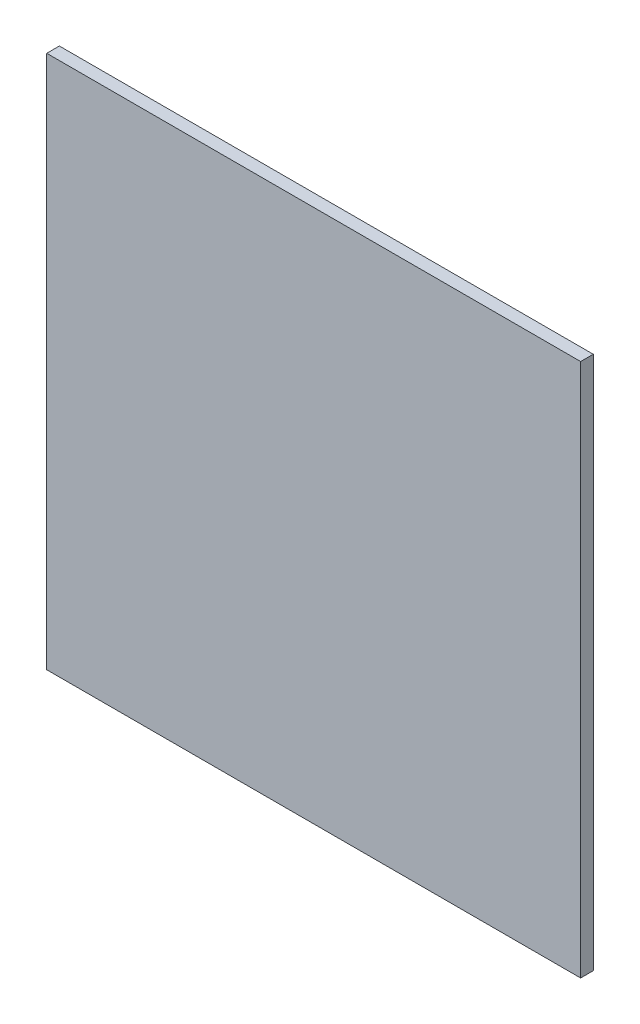
ISO-10303-21;
HEADER;
FILE_DESCRIPTION(('STEP AP214'),'2;1');
FILE_NAME('part.step','',(''),(''),'','','');
FILE_SCHEMA(('AUTOMOTIVE_DESIGN { 1 0 10303 214 1 1 1 1 }'));
ENDSEC;
DATA;
#1=APPLICATION_CONTEXT('core data for automotive mechanical design processes');
#2=APPLICATION_PROTOCOL_DEFINITION('international standard','automotive_design',2000,#1);
#3=PRODUCT_CONTEXT('',#1,'mechanical');
#4=PRODUCT('Part','Part','',(#3));
#5=PRODUCT_RELATED_PRODUCT_CATEGORY('part','',(#4));
#6=PRODUCT_DEFINITION_FORMATION('','',#4);
#7=PRODUCT_DEFINITION_CONTEXT('part definition',#1,'design');
#8=PRODUCT_DEFINITION('design','',#6,#7);
#9=PRODUCT_DEFINITION_SHAPE('','',#8);
#10=(LENGTH_UNIT() NAMED_UNIT(*) SI_UNIT(.MILLI.,.METRE.));
#11=(NAMED_UNIT(*) PLANE_ANGLE_UNIT() SI_UNIT($,.RADIAN.));
#12=(NAMED_UNIT(*) SI_UNIT($,.STERADIAN.) SOLID_ANGLE_UNIT());
#13=UNCERTAINTY_MEASURE_WITH_UNIT(LENGTH_MEASURE(1.E-05),#10,'distance_accuracy_value','');
#14=(GEOMETRIC_REPRESENTATION_CONTEXT(3) GLOBAL_UNCERTAINTY_ASSIGNED_CONTEXT((#13)) GLOBAL_UNIT_ASSIGNED_CONTEXT((#10,
#11,#12)) REPRESENTATION_CONTEXT('',''));
#15=CARTESIAN_POINT('',(0.,0.,0.));
#16=DIRECTION('',(0.,0.,1.));
#17=DIRECTION('',(1.,0.,0.));
#18=AXIS2_PLACEMENT_3D('',#15,#16,#17);
#19=CARTESIAN_POINT('',(4.62508,5.6,0.));
#20=DIRECTION('',(0.,0.,-1.));
#21=DIRECTION('',(-1.,0.,0.));
#22=AXIS2_PLACEMENT_3D('',#19,#20,#21);
#23=PLANE('',#22);
#24=DIRECTION('',(1.,0.,0.));
#25=VECTOR('',#24,1.);
#26=CARTESIAN_POINT('',(3.90008,6.325,0.));
#27=LINE('',#26,#25);
#28=CARTESIAN_POINT('',(3.90008,6.325,0.));
#29=VERTEX_POINT('',#28);
#30=CARTESIAN_POINT('',(5.35008,6.325,0.));
#31=VERTEX_POINT('',#30);
#32=EDGE_CURVE('E55',#29,#31,#27,.T.);
#33=ORIENTED_EDGE('',*,*,#32,.T.);
#34=DIRECTION('',(0.,1.,0.));
#35=VECTOR('',#34,1.);
#36=CARTESIAN_POINT('',(5.35008,6.325,0.));
#37=LINE('',#36,#35);
#38=CARTESIAN_POINT('',(5.35008,4.875,0.));
#39=VERTEX_POINT('',#38);
#40=EDGE_CURVE('E57',#31,#39,#37,.F.);
#41=ORIENTED_EDGE('',*,*,#40,.T.);
#42=DIRECTION('',(1.,0.,0.));
#43=VECTOR('',#42,1.);
#44=CARTESIAN_POINT('',(5.35008,4.875,0.));
#45=LINE('',#44,#43);
#46=CARTESIAN_POINT('',(3.90008,4.875,0.));
#47=VERTEX_POINT('',#46);
#48=EDGE_CURVE('E20',#39,#47,#45,.F.);
#49=ORIENTED_EDGE('',*,*,#48,.T.);
#50=DIRECTION('',(0.,1.,0.));
#51=VECTOR('',#50,1.);
#52=CARTESIAN_POINT('',(3.90008,4.875,0.));
#53=LINE('',#52,#51);
#54=EDGE_CURVE('E80',#47,#29,#53,.T.);
#55=ORIENTED_EDGE('',*,*,#54,.T.);
#56=EDGE_LOOP('',(#33,#41,#49,#55));
#57=FACE_BOUND('',#56,.T.);
#58=ADVANCED_FACE('F17',(#57),#23,.T.);
#59=CARTESIAN_POINT('',(5.35008,4.875,0.));
#60=DIRECTION('',(0.,1.,0.));
#61=DIRECTION('',(0.,0.,1.));
#62=AXIS2_PLACEMENT_3D('',#59,#60,#61);
#63=PLANE('',#62);
#64=DIRECTION('',(0.,0.,-1.));
#65=VECTOR('',#64,1.);
#66=CARTESIAN_POINT('',(3.90008,4.875,0.));
#67=LINE('',#66,#65);
#68=CARTESIAN_POINT('',(3.90008,4.875,0.03429));
#69=VERTEX_POINT('',#68);
#70=EDGE_CURVE('E68',#69,#47,#67,.T.);
#71=ORIENTED_EDGE('',*,*,#70,.T.);
#72=ORIENTED_EDGE('',*,*,#48,.F.);
#73=DIRECTION('',(0.,0.,1.));
#74=VECTOR('',#73,1.);
#75=CARTESIAN_POINT('',(5.35008,4.875,0.));
#76=LINE('',#75,#74);
#77=CARTESIAN_POINT('',(5.35008,4.875,0.03429));
#78=VERTEX_POINT('',#77);
#79=EDGE_CURVE('E63',#39,#78,#76,.T.);
#80=ORIENTED_EDGE('',*,*,#79,.T.);
#81=DIRECTION('',(1.,0.,0.));
#82=VECTOR('',#81,1.);
#83=CARTESIAN_POINT('',(4.62508,4.875,0.03429));
#84=LINE('',#83,#82);
#85=EDGE_CURVE('E83',#69,#78,#84,.T.);
#86=ORIENTED_EDGE('',*,*,#85,.F.);
#87=EDGE_LOOP('',(#71,#72,#80,#86));
#88=FACE_BOUND('',#87,.T.);
#89=ADVANCED_FACE('F65',(#88),#63,.F.);
#90=CARTESIAN_POINT('',(5.35008,6.325,0.));
#91=DIRECTION('',(-1.,0.,0.));
#92=DIRECTION('',(0.,0.,1.));
#93=AXIS2_PLACEMENT_3D('',#90,#91,#92);
#94=PLANE('',#93);
#95=ORIENTED_EDGE('',*,*,#79,.F.);
#96=ORIENTED_EDGE('',*,*,#40,.F.);
#97=DIRECTION('',(0.,0.,-1.));
#98=VECTOR('',#97,1.);
#99=CARTESIAN_POINT('',(5.35008,6.325,0.));
#100=LINE('',#99,#98);
#101=CARTESIAN_POINT('',(5.35008,6.325,0.03429));
#102=VERTEX_POINT('',#101);
#103=EDGE_CURVE('E75',#31,#102,#100,.F.);
#104=ORIENTED_EDGE('',*,*,#103,.T.);
#105=DIRECTION('',(0.,1.,0.));
#106=VECTOR('',#105,1.);
#107=CARTESIAN_POINT('',(5.35008,5.6,0.03429));
#108=LINE('',#107,#106);
#109=EDGE_CURVE('E72',#78,#102,#108,.T.);
#110=ORIENTED_EDGE('',*,*,#109,.F.);
#111=EDGE_LOOP('',(#95,#96,#104,#110));
#112=FACE_BOUND('',#111,.T.);
#113=ADVANCED_FACE('F70',(#112),#94,.F.);
#114=CARTESIAN_POINT('',(3.90008,6.325,0.));
#115=DIRECTION('',(0.,-1.,0.));
#116=DIRECTION('',(0.,0.,-1.));
#117=AXIS2_PLACEMENT_3D('',#114,#115,#116);
#118=PLANE('',#117);
#119=ORIENTED_EDGE('',*,*,#103,.F.);
#120=ORIENTED_EDGE('',*,*,#32,.F.);
#121=DIRECTION('',(0.,0.,-1.));
#122=VECTOR('',#121,1.);
#123=CARTESIAN_POINT('',(3.90008,6.325,0.));
#124=LINE('',#123,#122);
#125=CARTESIAN_POINT('',(3.90008,6.325,0.03429));
#126=VERTEX_POINT('',#125);
#127=EDGE_CURVE('E35',#29,#126,#124,.F.);
#128=ORIENTED_EDGE('',*,*,#127,.T.);
#129=DIRECTION('',(1.,0.,0.));
#130=VECTOR('',#129,1.);
#131=CARTESIAN_POINT('',(4.62508,6.325,0.03429));
#132=LINE('',#131,#130);
#133=EDGE_CURVE('E26',#102,#126,#132,.F.);
#134=ORIENTED_EDGE('',*,*,#133,.F.);
#135=EDGE_LOOP('',(#119,#120,#128,#134));
#136=FACE_BOUND('',#135,.T.);
#137=ADVANCED_FACE('F89',(#136),#118,.F.);
#138=CARTESIAN_POINT('',(3.90008,4.875,0.));
#139=DIRECTION('',(1.,0.,0.));
#140=DIRECTION('',(0.,0.,-1.));
#141=AXIS2_PLACEMENT_3D('',#138,#139,#140);
#142=PLANE('',#141);
#143=ORIENTED_EDGE('',*,*,#127,.F.);
#144=ORIENTED_EDGE('',*,*,#54,.F.);
#145=ORIENTED_EDGE('',*,*,#70,.F.);
#146=DIRECTION('',(0.,1.,0.));
#147=VECTOR('',#146,1.);
#148=CARTESIAN_POINT('',(3.90008,5.6,0.03429));
#149=LINE('',#148,#147);
#150=EDGE_CURVE('E11',#126,#69,#149,.F.);
#151=ORIENTED_EDGE('',*,*,#150,.F.);
#152=EDGE_LOOP('',(#143,#144,#145,#151));
#153=FACE_BOUND('',#152,.T.);
#154=ADVANCED_FACE('F91',(#153),#142,.F.);
#155=CARTESIAN_POINT('',(4.62508,5.6,0.03429));
#156=DIRECTION('',(0.,0.,1.));
#157=DIRECTION('',(1.,0.,0.));
#158=AXIS2_PLACEMENT_3D('',#155,#156,#157);
#159=PLANE('',#158);
#160=ORIENTED_EDGE('',*,*,#133,.T.);
#161=ORIENTED_EDGE('',*,*,#150,.T.);
#162=ORIENTED_EDGE('',*,*,#85,.T.);
#163=ORIENTED_EDGE('',*,*,#109,.T.);
#164=EDGE_LOOP('',(#160,#161,#162,#163));
#165=FACE_BOUND('',#164,.T.);
#166=ADVANCED_FACE('F88',(#165),#159,.T.);
#167=CLOSED_SHELL('',(#58,#89,#113,#137,#154,#166));
#168=MANIFOLD_SOLID_BREP('B1',#167);
#169=ADVANCED_BREP_SHAPE_REPRESENTATION('',(#18,#168),#14);
#170=SHAPE_DEFINITION_REPRESENTATION(#9,#169);
ENDSEC;
END-ISO-10303-21;
